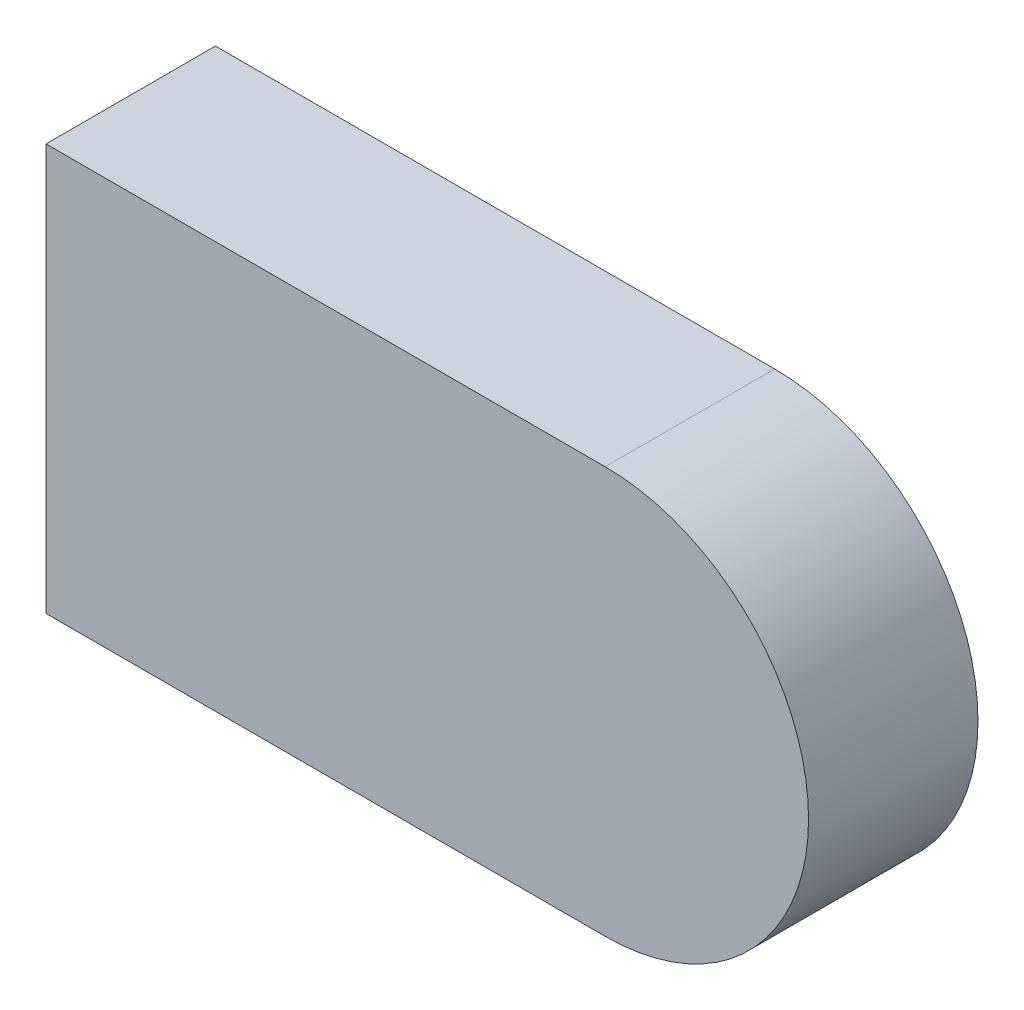
ISO-10303-21;
HEADER;
FILE_DESCRIPTION(('STEP AP214'),'2;1');
FILE_NAME('part.step','',(''),(''),'','','');
FILE_SCHEMA(('AUTOMOTIVE_DESIGN { 1 0 10303 214 1 1 1 1 }'));
ENDSEC;
DATA;
#1=APPLICATION_CONTEXT('core data for automotive mechanical design processes');
#2=APPLICATION_PROTOCOL_DEFINITION('international standard','automotive_design',2000,#1);
#3=PRODUCT_CONTEXT('',#1,'mechanical');
#4=PRODUCT('Part','Part','',(#3));
#5=PRODUCT_RELATED_PRODUCT_CATEGORY('part','',(#4));
#6=PRODUCT_DEFINITION_FORMATION('','',#4);
#7=PRODUCT_DEFINITION_CONTEXT('part definition',#1,'design');
#8=PRODUCT_DEFINITION('design','',#6,#7);
#9=PRODUCT_DEFINITION_SHAPE('','',#8);
#10=(LENGTH_UNIT() NAMED_UNIT(*) SI_UNIT(.MILLI.,.METRE.));
#11=(NAMED_UNIT(*) PLANE_ANGLE_UNIT() SI_UNIT($,.RADIAN.));
#12=(NAMED_UNIT(*) SI_UNIT($,.STERADIAN.) SOLID_ANGLE_UNIT());
#13=UNCERTAINTY_MEASURE_WITH_UNIT(LENGTH_MEASURE(1.E-05),#10,'distance_accuracy_value','');
#14=(GEOMETRIC_REPRESENTATION_CONTEXT(3) GLOBAL_UNCERTAINTY_ASSIGNED_CONTEXT((#13)) GLOBAL_UNIT_ASSIGNED_CONTEXT((#10,
#11,#12)) REPRESENTATION_CONTEXT('',''));
#15=CARTESIAN_POINT('',(0.,0.,0.));
#16=DIRECTION('',(0.,0.,1.));
#17=DIRECTION('',(1.,0.,0.));
#18=AXIS2_PLACEMENT_3D('',#15,#16,#17);
#19=CARTESIAN_POINT('',(-4.05,2.13,0.));
#20=DIRECTION('',(0.,1.,0.));
#21=DIRECTION('',(1.,0.,0.));
#22=AXIS2_PLACEMENT_3D('',#19,#20,#21);
#23=PLANE('',#22);
#24=DIRECTION('',(1.,0.,0.));
#25=VECTOR('',#24,1.);
#26=CARTESIAN_POINT('',(-4.05,2.13,0.));
#27=LINE('',#26,#25);
#28=CARTESIAN_POINT('',(-4.05,2.13,0.));
#29=VERTEX_POINT('',#28);
#30=CARTESIAN_POINT('',(-3.72,2.13,0.));
#31=VERTEX_POINT('',#30);
#32=EDGE_CURVE('E11',#29,#31,#27,.T.);
#33=ORIENTED_EDGE('',*,*,#32,.T.);
#34=DIRECTION('',(0.,0.,1.));
#35=VECTOR('',#34,1.);
#36=CARTESIAN_POINT('',(-3.72,2.13,0.));
#37=LINE('',#36,#35);
#38=CARTESIAN_POINT('',(-3.72,2.13,0.1));
#39=VERTEX_POINT('',#38);
#40=EDGE_CURVE('E24',#31,#39,#37,.T.);
#41=ORIENTED_EDGE('',*,*,#40,.T.);
#42=DIRECTION('',(1.,0.,0.));
#43=VECTOR('',#42,1.);
#44=CARTESIAN_POINT('',(-4.05,2.13,0.1));
#45=LINE('',#44,#43);
#46=CARTESIAN_POINT('',(-4.05,2.13,0.1));
#47=VERTEX_POINT('',#46);
#48=EDGE_CURVE('E88',#47,#39,#45,.T.);
#49=ORIENTED_EDGE('',*,*,#48,.F.);
#50=DIRECTION('',(0.,0.,1.));
#51=VECTOR('',#50,1.);
#52=CARTESIAN_POINT('',(-4.05,2.13,0.));
#53=LINE('',#52,#51);
#54=EDGE_CURVE('E36',#29,#47,#53,.T.);
#55=ORIENTED_EDGE('',*,*,#54,.F.);
#56=EDGE_LOOP('',(#33,#41,#49,#55));
#57=FACE_BOUND('',#56,.T.);
#58=ADVANCED_FACE('F17',(#57),#23,.F.);
#59=CARTESIAN_POINT('',(-3.72,2.25,0.));
#60=DIRECTION('',(0.,0.,-1.));
#61=DIRECTION('',(1.,0.,0.));
#62=AXIS2_PLACEMENT_3D('',#59,#60,#61);
#63=CYLINDRICAL_SURFACE('',#62,0.12);
#64=CARTESIAN_POINT('',(-3.72,2.25,0.));
#65=DIRECTION('',(0.,0.,1.));
#66=DIRECTION('',(1.,0.,0.));
#67=AXIS2_PLACEMENT_3D('',#64,#65,#66);
#68=CIRCLE('',#67,0.12);
#69=CARTESIAN_POINT('',(-3.72,2.37,0.));
#70=VERTEX_POINT('',#69);
#71=EDGE_CURVE('E85',#31,#70,#68,.T.);
#72=ORIENTED_EDGE('',*,*,#71,.T.);
#73=DIRECTION('',(0.,0.,1.));
#74=VECTOR('',#73,1.);
#75=CARTESIAN_POINT('',(-3.72,2.37,0.));
#76=LINE('',#75,#74);
#77=CARTESIAN_POINT('',(-3.72,2.37,0.1));
#78=VERTEX_POINT('',#77);
#79=EDGE_CURVE('E73',#70,#78,#76,.T.);
#80=ORIENTED_EDGE('',*,*,#79,.T.);
#81=CARTESIAN_POINT('',(-3.72,2.25,0.1));
#82=DIRECTION('',(0.,0.,1.));
#83=DIRECTION('',(1.,0.,0.));
#84=AXIS2_PLACEMENT_3D('',#81,#82,#83);
#85=CIRCLE('',#84,0.12);
#86=EDGE_CURVE('E66',#39,#78,#85,.T.);
#87=ORIENTED_EDGE('',*,*,#86,.F.);
#88=ORIENTED_EDGE('',*,*,#40,.F.);
#89=EDGE_LOOP('',(#72,#80,#87,#88));
#90=FACE_BOUND('',#89,.T.);
#91=ADVANCED_FACE('F89',(#90),#63,.T.);
#92=CARTESIAN_POINT('',(-4.05,2.37,0.));
#93=DIRECTION('',(0.,1.,0.));
#94=DIRECTION('',(1.,0.,0.));
#95=AXIS2_PLACEMENT_3D('',#92,#93,#94);
#96=PLANE('',#95);
#97=DIRECTION('',(0.,0.,1.));
#98=VECTOR('',#97,1.);
#99=CARTESIAN_POINT('',(-4.05,2.37,0.));
#100=LINE('',#99,#98);
#101=CARTESIAN_POINT('',(-4.05,2.37,0.));
#102=VERTEX_POINT('',#101);
#103=CARTESIAN_POINT('',(-4.05,2.37,0.1));
#104=VERTEX_POINT('',#103);
#105=EDGE_CURVE('E56',#102,#104,#100,.T.);
#106=ORIENTED_EDGE('',*,*,#105,.T.);
#107=DIRECTION('',(1.,0.,0.));
#108=VECTOR('',#107,1.);
#109=CARTESIAN_POINT('',(-4.05,2.37,0.1));
#110=LINE('',#109,#108);
#111=EDGE_CURVE('E67',#104,#78,#110,.T.);
#112=ORIENTED_EDGE('',*,*,#111,.T.);
#113=ORIENTED_EDGE('',*,*,#79,.F.);
#114=DIRECTION('',(1.,0.,0.));
#115=VECTOR('',#114,1.);
#116=CARTESIAN_POINT('',(-4.05,2.37,0.));
#117=LINE('',#116,#115);
#118=EDGE_CURVE('E71',#102,#70,#117,.T.);
#119=ORIENTED_EDGE('',*,*,#118,.F.);
#120=EDGE_LOOP('',(#106,#112,#113,#119));
#121=FACE_BOUND('',#120,.T.);
#122=ADVANCED_FACE('F72',(#121),#96,.T.);
#123=CARTESIAN_POINT('',(-4.05,2.13,0.));
#124=DIRECTION('',(-1.,0.,0.));
#125=DIRECTION('',(0.,1.,0.));
#126=AXIS2_PLACEMENT_3D('',#123,#124,#125);
#127=PLANE('',#126);
#128=ORIENTED_EDGE('',*,*,#54,.T.);
#129=DIRECTION('',(0.,1.,0.));
#130=VECTOR('',#129,1.);
#131=CARTESIAN_POINT('',(-4.05,2.13,0.1));
#132=LINE('',#131,#130);
#133=EDGE_CURVE('E62',#47,#104,#132,.T.);
#134=ORIENTED_EDGE('',*,*,#133,.T.);
#135=ORIENTED_EDGE('',*,*,#105,.F.);
#136=DIRECTION('',(0.,1.,0.));
#137=VECTOR('',#136,1.);
#138=CARTESIAN_POINT('',(-4.05,2.13,0.));
#139=LINE('',#138,#137);
#140=EDGE_CURVE('E60',#29,#102,#139,.T.);
#141=ORIENTED_EDGE('',*,*,#140,.F.);
#142=EDGE_LOOP('',(#128,#134,#135,#141));
#143=FACE_BOUND('',#142,.T.);
#144=ADVANCED_FACE('F58',(#143),#127,.T.);
#145=CARTESIAN_POINT('',(-3.849490847913,2.25,0.));
#146=DIRECTION('',(0.,0.,1.));
#147=DIRECTION('',(1.,0.,0.));
#148=AXIS2_PLACEMENT_3D('',#145,#146,#147);
#149=PLANE('',#148);
#150=ORIENTED_EDGE('',*,*,#140,.T.);
#151=ORIENTED_EDGE('',*,*,#118,.T.);
#152=ORIENTED_EDGE('',*,*,#71,.F.);
#153=ORIENTED_EDGE('',*,*,#32,.F.);
#154=EDGE_LOOP('',(#150,#151,#152,#153));
#155=FACE_BOUND('',#154,.T.);
#156=ADVANCED_FACE('F77',(#155),#149,.F.);
#157=CARTESIAN_POINT('',(-3.849490847913,2.25,0.1));
#158=DIRECTION('',(0.,0.,1.));
#159=DIRECTION('',(1.,0.,0.));
#160=AXIS2_PLACEMENT_3D('',#157,#158,#159);
#161=PLANE('',#160);
#162=ORIENTED_EDGE('',*,*,#48,.T.);
#163=ORIENTED_EDGE('',*,*,#86,.T.);
#164=ORIENTED_EDGE('',*,*,#111,.F.);
#165=ORIENTED_EDGE('',*,*,#133,.F.);
#166=EDGE_LOOP('',(#162,#163,#164,#165));
#167=FACE_BOUND('',#166,.T.);
#168=ADVANCED_FACE('F91',(#167),#161,.T.);
#169=CLOSED_SHELL('',(#58,#91,#122,#144,#156,#168));
#170=MANIFOLD_SOLID_BREP('B1',#169);
#171=ADVANCED_BREP_SHAPE_REPRESENTATION('',(#18,#170),#14);
#172=SHAPE_DEFINITION_REPRESENTATION(#9,#171);
ENDSEC;
END-ISO-10303-21;
